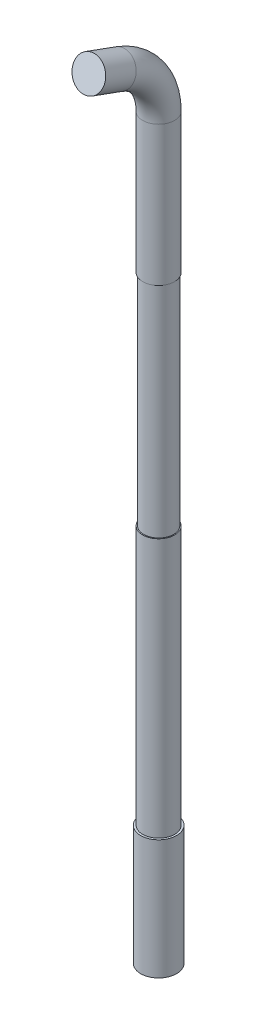
ISO-10303-21;
HEADER;
FILE_DESCRIPTION(('STEP AP214'),'2;1');
FILE_NAME('part.step','',(''),(''),'','','');
FILE_SCHEMA(('AUTOMOTIVE_DESIGN { 1 0 10303 214 1 1 1 1 }'));
ENDSEC;
DATA;
#1=APPLICATION_CONTEXT('core data for automotive mechanical design processes');
#2=APPLICATION_PROTOCOL_DEFINITION('international standard','automotive_design',2000,#1);
#3=PRODUCT_CONTEXT('',#1,'mechanical');
#4=PRODUCT('Part','Part','',(#3));
#5=PRODUCT_RELATED_PRODUCT_CATEGORY('part','',(#4));
#6=PRODUCT_DEFINITION_FORMATION('','',#4);
#7=PRODUCT_DEFINITION_CONTEXT('part definition',#1,'design');
#8=PRODUCT_DEFINITION('design','',#6,#7);
#9=PRODUCT_DEFINITION_SHAPE('','',#8);
#10=(LENGTH_UNIT() NAMED_UNIT(*) SI_UNIT(.MILLI.,.METRE.));
#11=(NAMED_UNIT(*) PLANE_ANGLE_UNIT() SI_UNIT($,.RADIAN.));
#12=(NAMED_UNIT(*) SI_UNIT($,.STERADIAN.) SOLID_ANGLE_UNIT());
#13=UNCERTAINTY_MEASURE_WITH_UNIT(LENGTH_MEASURE(1.E-05),#10,'distance_accuracy_value','');
#14=(GEOMETRIC_REPRESENTATION_CONTEXT(3) GLOBAL_UNCERTAINTY_ASSIGNED_CONTEXT((#13)) GLOBAL_UNIT_ASSIGNED_CONTEXT((#10,
#11,#12)) REPRESENTATION_CONTEXT('',''));
#15=CARTESIAN_POINT('',(0.,0.,0.));
#16=DIRECTION('',(0.,0.,1.));
#17=DIRECTION('',(1.,0.,0.));
#18=AXIS2_PLACEMENT_3D('',#15,#16,#17);
#19=CARTESIAN_POINT('',(0.,39.8190778623577,-7.02606042997699));
#20=DIRECTION('',(0.,0.342020143325665,0.93969262078591));
#21=DIRECTION('',(0.,-0.93969262078591,0.342020143325665));
#22=AXIS2_PLACEMENT_3D('',#19,#20,#21);
#23=CYLINDRICAL_SURFACE('',#22,0.8);
#24=CARTESIAN_POINT('',(0.,39.8190778623577,-7.02606042997699));
#25=DIRECTION('',(0.,0.342020143325665,0.93969262078591));
#26=DIRECTION('',(0.,-0.93969262078591,0.342020143325665));
#27=AXIS2_PLACEMENT_3D('',#24,#25,#26);
#28=CIRCLE('',#27,0.8);
#29=CARTESIAN_POINT('',(0.,40.5708319589865,-7.29967654463752));
#30=VERTEX_POINT('',#29);
#31=EDGE_CURVE('E38',#30,#30,#28,.T.);
#32=ORIENTED_EDGE('',*,*,#31,.T.);
#33=EDGE_LOOP('',(#32));
#34=FACE_BOUND('',#33,.T.);
#35=CARTESIAN_POINT('',(0.,40.3745184345608,-5.5));
#36=DIRECTION('',(0.,0.342020143325665,0.93969262078591));
#37=DIRECTION('',(0.,-0.93969262078591,0.342020143325665));
#38=AXIS2_PLACEMENT_3D('',#35,#36,#37);
#39=CIRCLE('',#38,0.8);
#40=CARTESIAN_POINT('',(0.,39.6227643379321,-5.22638388533946));
#41=VERTEX_POINT('',#40);
#42=EDGE_CURVE('E11',#41,#41,#39,.T.);
#43=ORIENTED_EDGE('',*,*,#42,.F.);
#44=EDGE_LOOP('',(#43));
#45=FACE_BOUND('',#44,.T.);
#46=ADVANCED_FACE('F31',(#34,#45),#23,.T.);
#47=CARTESIAN_POINT('',(0.,37.,-6.));
#48=DIRECTION('',(1.,0.,0.));
#49=DIRECTION('',(0.,0.,-1.));
#50=AXIS2_PLACEMENT_3D('',#47,#48,#49);
#51=TOROIDAL_SURFACE('',#50,3.,0.8);
#52=CARTESIAN_POINT('',(0.,37.,-9.));
#53=DIRECTION('',(0.,1.,0.));
#54=DIRECTION('',(0.,0.,1.));
#55=AXIS2_PLACEMENT_3D('',#52,#53,#54);
#56=CIRCLE('',#55,0.8);
#57=CARTESIAN_POINT('',(0.,37.,-9.8));
#58=VERTEX_POINT('',#57);
#59=EDGE_CURVE('E43',#58,#58,#56,.T.);
#60=CARTESIAN_POINT('',(0.,37.,-6.));
#61=DIRECTION('',(1.,0.,0.));
#62=DIRECTION('',(0.,0.,-1.));
#63=AXIS2_PLACEMENT_3D('',#60,#61,#62);
#64=CIRCLE('',#63,3.8);
#65=EDGE_CURVE('',#58,#30,#64,.T.);
#66=ORIENTED_EDGE('',*,*,#59,.T.);
#67=ORIENTED_EDGE('',*,*,#31,.F.);
#68=ORIENTED_EDGE('',*,*,#65,.T.);
#69=ORIENTED_EDGE('',*,*,#65,.F.);
#70=EDGE_LOOP('',(#66,#68,#67,#69));
#71=FACE_BOUND('',#70,.T.);
#72=ADVANCED_FACE('F71',(#71),#51,.T.);
#73=CARTESIAN_POINT('',(0.,37.,-9.));
#74=DIRECTION('',(0.,-1.,0.));
#75=DIRECTION('',(0.,0.,-1.));
#76=AXIS2_PLACEMENT_3D('',#73,#74,#75);
#77=CYLINDRICAL_SURFACE('',#76,0.8);
#78=CARTESIAN_POINT('',(0.,30.,-9.));
#79=DIRECTION('',(0.,1.,0.));
#80=DIRECTION('',(0.,0.,1.));
#81=AXIS2_PLACEMENT_3D('',#78,#79,#80);
#82=CIRCLE('',#81,0.8);
#83=CARTESIAN_POINT('',(0.,30.,-8.2));
#84=VERTEX_POINT('',#83);
#85=EDGE_CURVE('E34',#84,#84,#82,.T.);
#86=ORIENTED_EDGE('',*,*,#85,.T.);
#87=EDGE_LOOP('',(#86));
#88=FACE_BOUND('',#87,.T.);
#89=ORIENTED_EDGE('',*,*,#59,.F.);
#90=EDGE_LOOP('',(#89));
#91=FACE_BOUND('',#90,.T.);
#92=ADVANCED_FACE('F74',(#88,#91),#77,.T.);
#93=CARTESIAN_POINT('',(0.,40.3745184345608,-5.5));
#94=DIRECTION('',(0.,0.342020143325665,0.93969262078591));
#95=DIRECTION('',(0.,-0.93969262078591,0.342020143325665));
#96=AXIS2_PLACEMENT_3D('',#93,#94,#95);
#97=PLANE('',#96);
#98=ORIENTED_EDGE('',*,*,#42,.T.);
#99=EDGE_LOOP('',(#98));
#100=FACE_BOUND('',#99,.T.);
#101=ADVANCED_FACE('F76',(#100),#97,.T.);
#102=CARTESIAN_POINT('',(0.,30.,-7.56319194266973));
#103=DIRECTION('',(0.,1.,0.));
#104=DIRECTION('',(0.,0.,1.));
#105=AXIS2_PLACEMENT_3D('',#102,#103,#104);
#106=PLANE('',#105);
#107=CARTESIAN_POINT('',(0.,30.,-9.));
#108=DIRECTION('',(0.,1.,0.));
#109=DIRECTION('',(0.,0.,1.));
#110=AXIS2_PLACEMENT_3D('',#107,#108,#109);
#111=CIRCLE('',#110,0.75);
#112=CARTESIAN_POINT('',(0.,30.,-8.25));
#113=VERTEX_POINT('',#112);
#114=EDGE_CURVE('E52',#113,#113,#111,.T.);
#115=ORIENTED_EDGE('',*,*,#114,.T.);
#116=EDGE_LOOP('',(#115));
#117=FACE_BOUND('',#116,.T.);
#118=ORIENTED_EDGE('',*,*,#85,.F.);
#119=EDGE_LOOP('',(#118));
#120=FACE_BOUND('',#119,.T.);
#121=ADVANCED_FACE('F84',(#117,#120),#106,.F.);
#122=CARTESIAN_POINT('',(0.,19.,-7.56319194266973));
#123=DIRECTION('',(0.,1.,0.));
#124=DIRECTION('',(0.,0.,1.));
#125=AXIS2_PLACEMENT_3D('',#122,#123,#124);
#126=PLANE('',#125);
#127=CARTESIAN_POINT('',(0.,19.,-9.));
#128=DIRECTION('',(0.,1.,0.));
#129=DIRECTION('',(0.,0.,1.));
#130=AXIS2_PLACEMENT_3D('',#127,#128,#129);
#131=CIRCLE('',#130,0.75);
#132=CARTESIAN_POINT('',(0.,19.,-8.25));
#133=VERTEX_POINT('',#132);
#134=EDGE_CURVE('E58',#133,#133,#131,.T.);
#135=ORIENTED_EDGE('',*,*,#134,.F.);
#136=EDGE_LOOP('',(#135));
#137=FACE_BOUND('',#136,.T.);
#138=CARTESIAN_POINT('',(0.,19.,-9.));
#139=DIRECTION('',(0.,1.,0.));
#140=DIRECTION('',(0.,0.,1.));
#141=AXIS2_PLACEMENT_3D('',#138,#139,#140);
#142=CIRCLE('',#141,0.8);
#143=CARTESIAN_POINT('',(0.,19.,-8.2));
#144=VERTEX_POINT('',#143);
#145=EDGE_CURVE('E50',#144,#144,#142,.T.);
#146=ORIENTED_EDGE('',*,*,#145,.T.);
#147=EDGE_LOOP('',(#146));
#148=FACE_BOUND('',#147,.T.);
#149=ADVANCED_FACE('F151',(#137,#148),#126,.T.);
#150=CARTESIAN_POINT('',(0.,30.,-9.));
#151=DIRECTION('',(0.,-1.,0.));
#152=DIRECTION('',(0.,0.,-1.));
#153=AXIS2_PLACEMENT_3D('',#150,#151,#152);
#154=CYLINDRICAL_SURFACE('',#153,0.75);
#155=ORIENTED_EDGE('',*,*,#114,.F.);
#156=EDGE_LOOP('',(#155));
#157=FACE_BOUND('',#156,.T.);
#158=ORIENTED_EDGE('',*,*,#134,.T.);
#159=EDGE_LOOP('',(#158));
#160=FACE_BOUND('',#159,.T.);
#161=ADVANCED_FACE('F137',(#157,#160),#154,.T.);
#162=CARTESIAN_POINT('',(0.,0.,-9.));
#163=DIRECTION('',(0.,1.,0.));
#164=DIRECTION('',(0.,0.,1.));
#165=AXIS2_PLACEMENT_3D('',#162,#163,#164);
#166=PLANE('',#165);
#167=CARTESIAN_POINT('',(0.,0.,-9.));
#168=DIRECTION('',(0.,1.,0.));
#169=DIRECTION('',(0.,0.,1.));
#170=AXIS2_PLACEMENT_3D('',#167,#168,#169);
#171=CIRCLE('',#170,0.899999999999999);
#172=CARTESIAN_POINT('',(0.,0.,-8.1));
#173=VERTEX_POINT('',#172);
#174=EDGE_CURVE('E56',#173,#173,#171,.T.);
#175=ORIENTED_EDGE('',*,*,#174,.F.);
#176=EDGE_LOOP('',(#175));
#177=FACE_BOUND('',#176,.T.);
#178=ADVANCED_FACE('F128',(#177),#166,.F.);
#179=CARTESIAN_POINT('',(0.,6.,-9.));
#180=DIRECTION('',(0.,-1.,0.));
#181=DIRECTION('',(0.,0.,-1.));
#182=AXIS2_PLACEMENT_3D('',#179,#180,#181);
#183=CYLINDRICAL_SURFACE('',#182,0.899999999999999);
#184=CARTESIAN_POINT('',(0.,6.,-9.));
#185=DIRECTION('',(0.,1.,0.));
#186=DIRECTION('',(0.,0.,1.));
#187=AXIS2_PLACEMENT_3D('',#184,#185,#186);
#188=CIRCLE('',#187,0.899999999999999);
#189=CARTESIAN_POINT('',(0.,6.,-8.1));
#190=VERTEX_POINT('',#189);
#191=EDGE_CURVE('E49',#190,#190,#188,.T.);
#192=ORIENTED_EDGE('',*,*,#191,.F.);
#193=EDGE_LOOP('',(#192));
#194=FACE_BOUND('',#193,.T.);
#195=ORIENTED_EDGE('',*,*,#174,.T.);
#196=EDGE_LOOP('',(#195));
#197=FACE_BOUND('',#196,.T.);
#198=ADVANCED_FACE('F118',(#194,#197),#183,.T.);
#199=CARTESIAN_POINT('',(0.,6.,-9.));
#200=DIRECTION('',(0.,1.,0.));
#201=DIRECTION('',(0.,0.,1.));
#202=AXIS2_PLACEMENT_3D('',#199,#200,#201);
#203=PLANE('',#202);
#204=ORIENTED_EDGE('',*,*,#191,.T.);
#205=EDGE_LOOP('',(#204));
#206=FACE_BOUND('',#205,.T.);
#207=CARTESIAN_POINT('',(0.,6.,-9.));
#208=DIRECTION('',(0.,1.,0.));
#209=DIRECTION('',(0.,0.,1.));
#210=AXIS2_PLACEMENT_3D('',#207,#208,#209);
#211=CIRCLE('',#210,0.8);
#212=CARTESIAN_POINT('',(0.,6.,-8.2));
#213=VERTEX_POINT('',#212);
#214=EDGE_CURVE('E47',#213,#213,#211,.T.);
#215=ORIENTED_EDGE('',*,*,#214,.F.);
#216=EDGE_LOOP('',(#215));
#217=FACE_BOUND('',#216,.T.);
#218=ADVANCED_FACE('F88',(#206,#217),#203,.T.);
#219=ORIENTED_EDGE('',*,*,#214,.T.);
#220=EDGE_LOOP('',(#219));
#221=FACE_BOUND('',#220,.T.);
#222=ORIENTED_EDGE('',*,*,#145,.F.);
#223=EDGE_LOOP('',(#222));
#224=FACE_BOUND('',#223,.T.);
#225=ADVANCED_FACE('F79',(#221,#224),#77,.T.);
#226=CLOSED_SHELL('',(#46,#72,#92,#101,#121,#149,#161,#178,#198,#218,#225));
#227=MANIFOLD_SOLID_BREP('B2',#226);
#228=ADVANCED_BREP_SHAPE_REPRESENTATION('',(#18,#227),#14);
#229=SHAPE_DEFINITION_REPRESENTATION(#9,#228);
ENDSEC;
END-ISO-10303-21;
